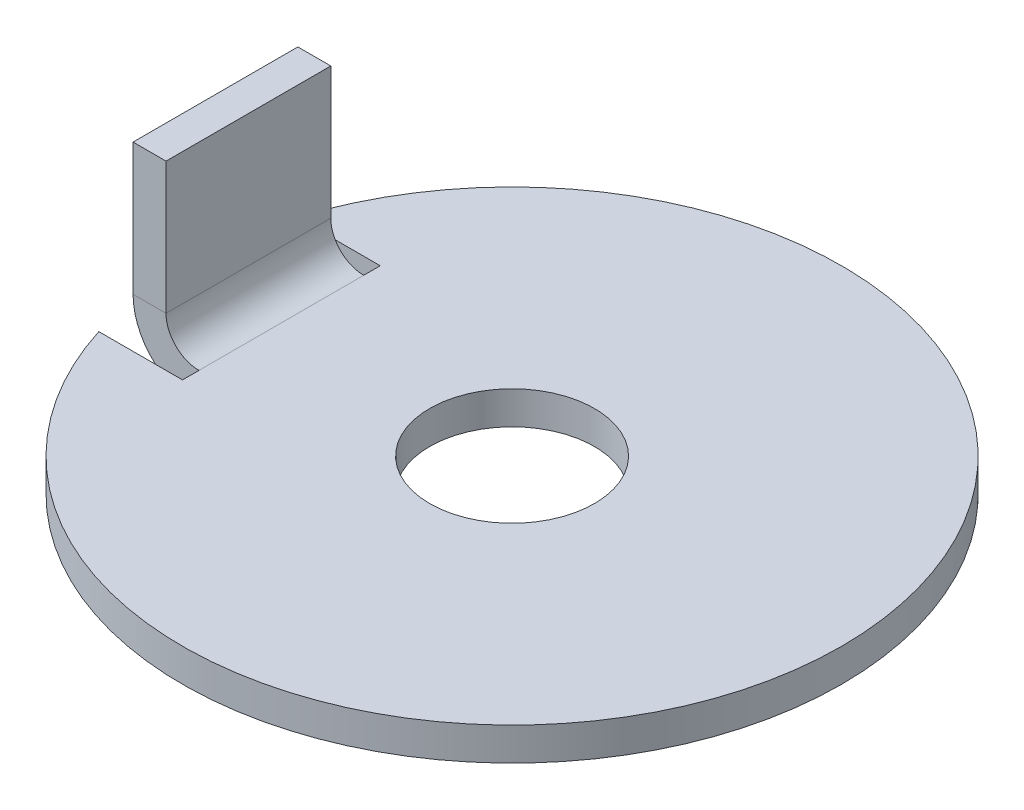
ISO-10303-21;
HEADER;
FILE_DESCRIPTION(('STEP AP214'),'2;1');
FILE_NAME('part.step','',(''),(''),'','','');
FILE_SCHEMA(('AUTOMOTIVE_DESIGN { 1 0 10303 214 1 1 1 1 }'));
ENDSEC;
DATA;
#1=APPLICATION_CONTEXT('core data for automotive mechanical design processes');
#2=APPLICATION_PROTOCOL_DEFINITION('international standard','automotive_design',2000,#1);
#3=PRODUCT_CONTEXT('',#1,'mechanical');
#4=PRODUCT('Part','Part','',(#3));
#5=PRODUCT_RELATED_PRODUCT_CATEGORY('part','',(#4));
#6=PRODUCT_DEFINITION_FORMATION('','',#4);
#7=PRODUCT_DEFINITION_CONTEXT('part definition',#1,'design');
#8=PRODUCT_DEFINITION('design','',#6,#7);
#9=PRODUCT_DEFINITION_SHAPE('','',#8);
#10=(LENGTH_UNIT() NAMED_UNIT(*) SI_UNIT(.MILLI.,.METRE.));
#11=(NAMED_UNIT(*) PLANE_ANGLE_UNIT() SI_UNIT($,.RADIAN.));
#12=(NAMED_UNIT(*) SI_UNIT($,.STERADIAN.) SOLID_ANGLE_UNIT());
#13=UNCERTAINTY_MEASURE_WITH_UNIT(LENGTH_MEASURE(1.E-05),#10,'distance_accuracy_value','');
#14=(GEOMETRIC_REPRESENTATION_CONTEXT(3) GLOBAL_UNCERTAINTY_ASSIGNED_CONTEXT((#13)) GLOBAL_UNIT_ASSIGNED_CONTEXT((#10,
#11,#12)) REPRESENTATION_CONTEXT('',''));
#15=CARTESIAN_POINT('',(0.,0.,0.));
#16=DIRECTION('',(0.,0.,1.));
#17=DIRECTION('',(1.,0.,0.));
#18=AXIS2_PLACEMENT_3D('',#15,#16,#17);
#19=CARTESIAN_POINT('',(-7.,0.,2.5));
#20=DIRECTION('',(0.,0.,1.));
#21=DIRECTION('',(1.,0.,0.));
#22=AXIS2_PLACEMENT_3D('',#19,#20,#21);
#23=PLANE('',#22);
#24=DIRECTION('',(0.,-1.,0.));
#25=VECTOR('',#24,1.);
#26=CARTESIAN_POINT('',(-7.,0.,2.5));
#27=LINE('',#26,#25);
#28=CARTESIAN_POINT('',(-7.,0.,2.5));
#29=VERTEX_POINT('',#28);
#30=CARTESIAN_POINT('',(-7.,-1.,2.5));
#31=VERTEX_POINT('',#30);
#32=EDGE_CURVE('E11',#29,#31,#27,.T.);
#33=ORIENTED_EDGE('',*,*,#32,.F.);
#34=CARTESIAN_POINT('',(-7.,1.,2.5));
#35=DIRECTION('',(0.,0.,-1.));
#36=DIRECTION('',(-1.,0.,0.));
#37=AXIS2_PLACEMENT_3D('',#34,#35,#36);
#38=CIRCLE('',#37,1.);
#39=CARTESIAN_POINT('',(-8.,1.,2.5));
#40=VERTEX_POINT('',#39);
#41=EDGE_CURVE('E125',#40,#29,#38,.F.);
#42=ORIENTED_EDGE('',*,*,#41,.F.);
#43=DIRECTION('',(1.,0.,0.));
#44=VECTOR('',#43,1.);
#45=CARTESIAN_POINT('',(-9.,1.,2.5));
#46=LINE('',#45,#44);
#47=CARTESIAN_POINT('',(-9.,1.,2.5));
#48=VERTEX_POINT('',#47);
#49=EDGE_CURVE('E45',#48,#40,#46,.T.);
#50=ORIENTED_EDGE('',*,*,#49,.F.);
#51=CARTESIAN_POINT('',(-7.,1.,2.5));
#52=DIRECTION('',(0.,0.,1.));
#53=DIRECTION('',(1.,0.,0.));
#54=AXIS2_PLACEMENT_3D('',#51,#52,#53);
#55=CIRCLE('',#54,2.);
#56=EDGE_CURVE('E53',#48,#31,#55,.T.);
#57=ORIENTED_EDGE('',*,*,#56,.T.);
#58=EDGE_LOOP('',(#33,#42,#50,#57));
#59=FACE_BOUND('',#58,.T.);
#60=ADVANCED_FACE('F37',(#59),#23,.T.);
#61=CARTESIAN_POINT('',(-8.,1.,-2.5));
#62=DIRECTION('',(0.,0.,-1.));
#63=DIRECTION('',(-1.,0.,0.));
#64=AXIS2_PLACEMENT_3D('',#61,#62,#63);
#65=PLANE('',#64);
#66=DIRECTION('',(-1.,0.,0.));
#67=VECTOR('',#66,1.);
#68=CARTESIAN_POINT('',(-8.,1.,-2.5));
#69=LINE('',#68,#67);
#70=CARTESIAN_POINT('',(-8.,1.,-2.5));
#71=VERTEX_POINT('',#70);
#72=CARTESIAN_POINT('',(-9.,1.,-2.5));
#73=VERTEX_POINT('',#72);
#74=EDGE_CURVE('E76',#71,#73,#69,.T.);
#75=ORIENTED_EDGE('',*,*,#74,.F.);
#76=CARTESIAN_POINT('',(-7.,1.,-2.5));
#77=DIRECTION('',(0.,0.,-1.));
#78=DIRECTION('',(-1.,0.,0.));
#79=AXIS2_PLACEMENT_3D('',#76,#77,#78);
#80=CIRCLE('',#79,1.);
#81=CARTESIAN_POINT('',(-7.,0.,-2.5));
#82=VERTEX_POINT('',#81);
#83=EDGE_CURVE('E131',#71,#82,#80,.F.);
#84=ORIENTED_EDGE('',*,*,#83,.T.);
#85=DIRECTION('',(0.,1.,0.));
#86=VECTOR('',#85,1.);
#87=CARTESIAN_POINT('',(-7.,-1.,-2.5));
#88=LINE('',#87,#86);
#89=CARTESIAN_POINT('',(-7.,-1.,-2.5));
#90=VERTEX_POINT('',#89);
#91=EDGE_CURVE('E84',#90,#82,#88,.T.);
#92=ORIENTED_EDGE('',*,*,#91,.F.);
#93=CARTESIAN_POINT('',(-7.,1.,-2.5));
#94=DIRECTION('',(0.,0.,1.));
#95=DIRECTION('',(1.,0.,0.));
#96=AXIS2_PLACEMENT_3D('',#93,#94,#95);
#97=CIRCLE('',#96,2.);
#98=EDGE_CURVE('E139',#73,#90,#97,.T.);
#99=ORIENTED_EDGE('',*,*,#98,.F.);
#100=EDGE_LOOP('',(#75,#84,#92,#99));
#101=FACE_BOUND('',#100,.T.);
#102=ADVANCED_FACE('F163',(#101),#65,.T.);
#103=CARTESIAN_POINT('',(-7.,-1.,-2.5));
#104=DIRECTION('',(0.,0.,-1.));
#105=DIRECTION('',(-1.,0.,0.));
#106=AXIS2_PLACEMENT_3D('',#103,#104,#105);
#107=PLANE('',#106);
#108=DIRECTION('',(0.,-1.,0.));
#109=VECTOR('',#108,1.);
#110=CARTESIAN_POINT('',(-8.,5.,-2.5));
#111=LINE('',#110,#109);
#112=CARTESIAN_POINT('',(-8.,5.,-2.5));
#113=VERTEX_POINT('',#112);
#114=EDGE_CURVE('E133',#113,#71,#111,.T.);
#115=ORIENTED_EDGE('',*,*,#114,.T.);
#116=ORIENTED_EDGE('',*,*,#74,.T.);
#117=DIRECTION('',(0.,1.,0.));
#118=VECTOR('',#117,1.);
#119=CARTESIAN_POINT('',(-9.,5.,-2.5));
#120=LINE('',#119,#118);
#121=CARTESIAN_POINT('',(-9.,5.,-2.5));
#122=VERTEX_POINT('',#121);
#123=EDGE_CURVE('E137',#122,#73,#120,.F.);
#124=ORIENTED_EDGE('',*,*,#123,.F.);
#125=DIRECTION('',(1.,0.,0.));
#126=VECTOR('',#125,1.);
#127=CARTESIAN_POINT('',(-9.,5.,-2.5));
#128=LINE('',#127,#126);
#129=EDGE_CURVE('E108',#122,#113,#128,.T.);
#130=ORIENTED_EDGE('',*,*,#129,.T.);
#131=EDGE_LOOP('',(#115,#116,#124,#130));
#132=FACE_BOUND('',#131,.T.);
#133=ADVANCED_FACE('F160',(#132),#107,.T.);
#134=CARTESIAN_POINT('',(-8.,-1.,2.5));
#135=DIRECTION('',(0.,1.,0.));
#136=DIRECTION('',(0.,0.,1.));
#137=AXIS2_PLACEMENT_3D('',#134,#135,#136);
#138=PLANE('',#137);
#139=CARTESIAN_POINT('',(0.,-1.,0.));
#140=DIRECTION('',(0.,1.,0.));
#141=DIRECTION('',(0.,0.,1.));
#142=AXIS2_PLACEMENT_3D('',#139,#140,#141);
#143=CIRCLE('',#142,2.5);
#144=CARTESIAN_POINT('',(0.,-1.,2.5));
#145=VERTEX_POINT('',#144);
#146=EDGE_CURVE('E215',#145,#145,#143,.T.);
#147=ORIENTED_EDGE('',*,*,#146,.T.);
#148=EDGE_LOOP('',(#147));
#149=FACE_BOUND('',#148,.T.);
#150=DIRECTION('',(0.,0.,-1.));
#151=VECTOR('',#150,1.);
#152=CARTESIAN_POINT('',(-7.,-1.,2.5));
#153=LINE('',#152,#151);
#154=EDGE_CURVE('E130',#31,#90,#153,.T.);
#155=ORIENTED_EDGE('',*,*,#154,.T.);
#156=DIRECTION('',(0.,0.,1.));
#157=VECTOR('',#156,1.);
#158=CARTESIAN_POINT('',(-7.,-1.,3.));
#159=LINE('',#158,#157);
#160=CARTESIAN_POINT('',(-7.,-1.,-3.));
#161=VERTEX_POINT('',#160);
#162=EDGE_CURVE('E173',#161,#90,#159,.T.);
#163=ORIENTED_EDGE('',*,*,#162,.F.);
#164=DIRECTION('',(1.,0.,0.));
#165=VECTOR('',#164,1.);
#166=CARTESIAN_POINT('',(-7.,-1.,-3.));
#167=LINE('',#166,#165);
#168=CARTESIAN_POINT('',(-9.53939201416946,-1.,-3.));
#169=VERTEX_POINT('',#168);
#170=EDGE_CURVE('E208',#169,#161,#167,.T.);
#171=ORIENTED_EDGE('',*,*,#170,.F.);
#172=CARTESIAN_POINT('',(0.,-1.,0.));
#173=DIRECTION('',(0.,1.,0.));
#174=DIRECTION('',(0.,0.,1.));
#175=AXIS2_PLACEMENT_3D('',#172,#173,#174);
#176=CIRCLE('',#175,10.);
#177=CARTESIAN_POINT('',(-9.53939201416946,-1.,3.));
#178=VERTEX_POINT('',#177);
#179=EDGE_CURVE('E185',#178,#169,#176,.T.);
#180=ORIENTED_EDGE('',*,*,#179,.F.);
#181=DIRECTION('',(-1.,0.,0.));
#182=VECTOR('',#181,1.);
#183=CARTESIAN_POINT('',(-7.,-1.,3.));
#184=LINE('',#183,#182);
#185=CARTESIAN_POINT('',(-7.,-1.,3.));
#186=VERTEX_POINT('',#185);
#187=EDGE_CURVE('E181',#186,#178,#184,.T.);
#188=ORIENTED_EDGE('',*,*,#187,.F.);
#189=EDGE_CURVE('E205',#31,#186,#159,.T.);
#190=ORIENTED_EDGE('',*,*,#189,.F.);
#191=EDGE_LOOP('',(#155,#163,#171,#180,#188,#190));
#192=FACE_BOUND('',#191,.T.);
#193=ADVANCED_FACE('F240',(#149,#192),#138,.F.);
#194=CARTESIAN_POINT('',(-8.,0.,2.5));
#195=DIRECTION('',(0.,1.,0.));
#196=DIRECTION('',(0.,0.,1.));
#197=AXIS2_PLACEMENT_3D('',#194,#195,#196);
#198=PLANE('',#197);
#199=CARTESIAN_POINT('',(0.,0.,0.));
#200=DIRECTION('',(0.,1.,0.));
#201=DIRECTION('',(0.,0.,1.));
#202=AXIS2_PLACEMENT_3D('',#199,#200,#201);
#203=CIRCLE('',#202,2.5);
#204=CARTESIAN_POINT('',(0.,0.,2.5));
#205=VERTEX_POINT('',#204);
#206=EDGE_CURVE('E243',#205,#205,#203,.T.);
#207=ORIENTED_EDGE('',*,*,#206,.F.);
#208=EDGE_LOOP('',(#207));
#209=FACE_BOUND('',#208,.T.);
#210=DIRECTION('',(0.,0.,-1.));
#211=VECTOR('',#210,1.);
#212=CARTESIAN_POINT('',(-7.,0.,2.5));
#213=LINE('',#212,#211);
#214=EDGE_CURVE('E148',#29,#82,#213,.T.);
#215=ORIENTED_EDGE('',*,*,#214,.F.);
#216=DIRECTION('',(0.,0.,1.));
#217=VECTOR('',#216,1.);
#218=CARTESIAN_POINT('',(-7.,0.,3.));
#219=LINE('',#218,#217);
#220=CARTESIAN_POINT('',(-7.,0.,3.));
#221=VERTEX_POINT('',#220);
#222=EDGE_CURVE('E182',#29,#221,#219,.T.);
#223=ORIENTED_EDGE('',*,*,#222,.T.);
#224=DIRECTION('',(-1.,0.,0.));
#225=VECTOR('',#224,1.);
#226=CARTESIAN_POINT('',(-7.,0.,3.));
#227=LINE('',#226,#225);
#228=CARTESIAN_POINT('',(-9.53939201416946,0.,3.));
#229=VERTEX_POINT('',#228);
#230=EDGE_CURVE('E212',#221,#229,#227,.T.);
#231=ORIENTED_EDGE('',*,*,#230,.T.);
#232=CARTESIAN_POINT('',(0.,0.,0.));
#233=DIRECTION('',(0.,1.,0.));
#234=DIRECTION('',(0.,0.,1.));
#235=AXIS2_PLACEMENT_3D('',#232,#233,#234);
#236=CIRCLE('',#235,10.);
#237=CARTESIAN_POINT('',(-9.53939201416946,0.,-3.));
#238=VERTEX_POINT('',#237);
#239=EDGE_CURVE('E214',#229,#238,#236,.T.);
#240=ORIENTED_EDGE('',*,*,#239,.T.);
#241=DIRECTION('',(1.,0.,0.));
#242=VECTOR('',#241,1.);
#243=CARTESIAN_POINT('',(-7.,0.,-3.));
#244=LINE('',#243,#242);
#245=CARTESIAN_POINT('',(-7.,0.,-3.));
#246=VERTEX_POINT('',#245);
#247=EDGE_CURVE('E180',#238,#246,#244,.T.);
#248=ORIENTED_EDGE('',*,*,#247,.T.);
#249=EDGE_CURVE('E171',#246,#82,#219,.T.);
#250=ORIENTED_EDGE('',*,*,#249,.T.);
#251=EDGE_LOOP('',(#215,#223,#231,#240,#248,#250));
#252=FACE_BOUND('',#251,.T.);
#253=ADVANCED_FACE('F176',(#209,#252),#198,.T.);
#254=CARTESIAN_POINT('',(-7.,1.,2.5));
#255=DIRECTION('',(0.,0.,-1.));
#256=DIRECTION('',(-1.,0.,0.));
#257=AXIS2_PLACEMENT_3D('',#254,#255,#256);
#258=CYLINDRICAL_SURFACE('',#257,1.);
#259=ORIENTED_EDGE('',*,*,#83,.F.);
#260=DIRECTION('',(0.,0.,-1.));
#261=VECTOR('',#260,1.);
#262=CARTESIAN_POINT('',(-8.,1.,2.5));
#263=LINE('',#262,#261);
#264=EDGE_CURVE('E145',#40,#71,#263,.T.);
#265=ORIENTED_EDGE('',*,*,#264,.F.);
#266=ORIENTED_EDGE('',*,*,#41,.T.);
#267=ORIENTED_EDGE('',*,*,#214,.T.);
#268=EDGE_LOOP('',(#259,#265,#266,#267));
#269=FACE_BOUND('',#268,.T.);
#270=ADVANCED_FACE('F155',(#269),#258,.F.);
#271=CARTESIAN_POINT('',(-8.,5.,2.5));
#272=DIRECTION('',(1.,0.,0.));
#273=DIRECTION('',(0.,0.,-1.));
#274=AXIS2_PLACEMENT_3D('',#271,#272,#273);
#275=PLANE('',#274);
#276=ORIENTED_EDGE('',*,*,#114,.F.);
#277=DIRECTION('',(0.,0.,-1.));
#278=VECTOR('',#277,1.);
#279=CARTESIAN_POINT('',(-8.,5.,2.5));
#280=LINE('',#279,#278);
#281=CARTESIAN_POINT('',(-8.,5.,2.5));
#282=VERTEX_POINT('',#281);
#283=EDGE_CURVE('E110',#282,#113,#280,.T.);
#284=ORIENTED_EDGE('',*,*,#283,.F.);
#285=DIRECTION('',(0.,-1.,0.));
#286=VECTOR('',#285,1.);
#287=CARTESIAN_POINT('',(-8.,5.,2.5));
#288=LINE('',#287,#286);
#289=EDGE_CURVE('E123',#282,#40,#288,.T.);
#290=ORIENTED_EDGE('',*,*,#289,.T.);
#291=ORIENTED_EDGE('',*,*,#264,.T.);
#292=EDGE_LOOP('',(#276,#284,#290,#291));
#293=FACE_BOUND('',#292,.T.);
#294=ADVANCED_FACE('F159',(#293),#275,.T.);
#295=CARTESIAN_POINT('',(-9.,5.,2.5));
#296=DIRECTION('',(0.,1.,0.));
#297=DIRECTION('',(0.,0.,1.));
#298=AXIS2_PLACEMENT_3D('',#295,#296,#297);
#299=PLANE('',#298);
#300=ORIENTED_EDGE('',*,*,#129,.F.);
#301=DIRECTION('',(0.,0.,-1.));
#302=VECTOR('',#301,1.);
#303=CARTESIAN_POINT('',(-9.,5.,2.5));
#304=LINE('',#303,#302);
#305=CARTESIAN_POINT('',(-9.,5.,2.5));
#306=VERTEX_POINT('',#305);
#307=EDGE_CURVE('E102',#306,#122,#304,.T.);
#308=ORIENTED_EDGE('',*,*,#307,.F.);
#309=DIRECTION('',(1.,0.,0.));
#310=VECTOR('',#309,1.);
#311=CARTESIAN_POINT('',(-9.,5.,2.5));
#312=LINE('',#311,#310);
#313=EDGE_CURVE('E106',#306,#282,#312,.T.);
#314=ORIENTED_EDGE('',*,*,#313,.T.);
#315=ORIENTED_EDGE('',*,*,#283,.T.);
#316=EDGE_LOOP('',(#300,#308,#314,#315));
#317=FACE_BOUND('',#316,.T.);
#318=ADVANCED_FACE('F104',(#317),#299,.T.);
#319=CARTESIAN_POINT('',(-9.,5.,2.5));
#320=DIRECTION('',(1.,0.,0.));
#321=DIRECTION('',(0.,0.,-1.));
#322=AXIS2_PLACEMENT_3D('',#319,#320,#321);
#323=PLANE('',#322);
#324=ORIENTED_EDGE('',*,*,#123,.T.);
#325=DIRECTION('',(0.,0.,-1.));
#326=VECTOR('',#325,1.);
#327=CARTESIAN_POINT('',(-9.,1.,2.5));
#328=LINE('',#327,#326);
#329=EDGE_CURVE('E111',#48,#73,#328,.T.);
#330=ORIENTED_EDGE('',*,*,#329,.F.);
#331=DIRECTION('',(0.,1.,0.));
#332=VECTOR('',#331,1.);
#333=CARTESIAN_POINT('',(-9.,5.,2.5));
#334=LINE('',#333,#332);
#335=EDGE_CURVE('E115',#306,#48,#334,.F.);
#336=ORIENTED_EDGE('',*,*,#335,.F.);
#337=ORIENTED_EDGE('',*,*,#307,.T.);
#338=EDGE_LOOP('',(#324,#330,#336,#337));
#339=FACE_BOUND('',#338,.T.);
#340=ADVANCED_FACE('F116',(#339),#323,.F.);
#341=CARTESIAN_POINT('',(-7.,1.,2.5));
#342=DIRECTION('',(0.,0.,-1.));
#343=DIRECTION('',(-1.,0.,0.));
#344=AXIS2_PLACEMENT_3D('',#341,#342,#343);
#345=CYLINDRICAL_SURFACE('',#344,2.);
#346=ORIENTED_EDGE('',*,*,#98,.T.);
#347=ORIENTED_EDGE('',*,*,#154,.F.);
#348=ORIENTED_EDGE('',*,*,#56,.F.);
#349=ORIENTED_EDGE('',*,*,#329,.T.);
#350=EDGE_LOOP('',(#346,#347,#348,#349));
#351=FACE_BOUND('',#350,.T.);
#352=ADVANCED_FACE('F162',(#351),#345,.T.);
#353=CARTESIAN_POINT('',(-7.,1.,2.5));
#354=DIRECTION('',(0.,0.,-1.));
#355=DIRECTION('',(-1.,0.,0.));
#356=AXIS2_PLACEMENT_3D('',#353,#354,#355);
#357=PLANE('',#356);
#358=ORIENTED_EDGE('',*,*,#335,.T.);
#359=ORIENTED_EDGE('',*,*,#49,.T.);
#360=ORIENTED_EDGE('',*,*,#289,.F.);
#361=ORIENTED_EDGE('',*,*,#313,.F.);
#362=EDGE_LOOP('',(#358,#359,#360,#361));
#363=FACE_BOUND('',#362,.T.);
#364=ADVANCED_FACE('F121',(#363),#357,.F.);
#365=CARTESIAN_POINT('',(-7.,-1.,3.));
#366=DIRECTION('',(-1.,0.,0.));
#367=DIRECTION('',(0.,0.,1.));
#368=AXIS2_PLACEMENT_3D('',#365,#366,#367);
#369=PLANE('',#368);
#370=ORIENTED_EDGE('',*,*,#222,.F.);
#371=ORIENTED_EDGE('',*,*,#32,.T.);
#372=ORIENTED_EDGE('',*,*,#189,.T.);
#373=DIRECTION('',(0.,1.,0.));
#374=VECTOR('',#373,1.);
#375=CARTESIAN_POINT('',(-7.,-1.,3.));
#376=LINE('',#375,#374);
#377=EDGE_CURVE('E134',#186,#221,#376,.T.);
#378=ORIENTED_EDGE('',*,*,#377,.T.);
#379=EDGE_LOOP('',(#370,#371,#372,#378));
#380=FACE_BOUND('',#379,.T.);
#381=ADVANCED_FACE('F236',(#380),#369,.T.);
#382=CARTESIAN_POINT('',(-7.,-1.,3.));
#383=DIRECTION('',(0.,0.,-1.));
#384=DIRECTION('',(-1.,0.,0.));
#385=AXIS2_PLACEMENT_3D('',#382,#383,#384);
#386=PLANE('',#385);
#387=ORIENTED_EDGE('',*,*,#230,.F.);
#388=ORIENTED_EDGE('',*,*,#377,.F.);
#389=ORIENTED_EDGE('',*,*,#187,.T.);
#390=DIRECTION('',(0.,1.,0.));
#391=VECTOR('',#390,1.);
#392=CARTESIAN_POINT('',(-9.53939201416946,-1.,3.));
#393=LINE('',#392,#391);
#394=EDGE_CURVE('E198',#178,#229,#393,.T.);
#395=ORIENTED_EDGE('',*,*,#394,.T.);
#396=EDGE_LOOP('',(#387,#388,#389,#395));
#397=FACE_BOUND('',#396,.T.);
#398=ADVANCED_FACE('F239',(#397),#386,.T.);
#399=ORIENTED_EDGE('',*,*,#162,.T.);
#400=ORIENTED_EDGE('',*,*,#91,.T.);
#401=ORIENTED_EDGE('',*,*,#249,.F.);
#402=DIRECTION('',(0.,1.,0.));
#403=VECTOR('',#402,1.);
#404=CARTESIAN_POINT('',(-7.,-1.,-3.));
#405=LINE('',#404,#403);
#406=EDGE_CURVE('E192',#161,#246,#405,.T.);
#407=ORIENTED_EDGE('',*,*,#406,.F.);
#408=EDGE_LOOP('',(#399,#400,#401,#407));
#409=FACE_BOUND('',#408,.T.);
#410=ADVANCED_FACE('F168',(#409),#369,.T.);
#411=CARTESIAN_POINT('',(-7.,-1.,-3.));
#412=DIRECTION('',(0.,0.,1.));
#413=DIRECTION('',(1.,0.,0.));
#414=AXIS2_PLACEMENT_3D('',#411,#412,#413);
#415=PLANE('',#414);
#416=ORIENTED_EDGE('',*,*,#247,.F.);
#417=DIRECTION('',(0.,1.,0.));
#418=VECTOR('',#417,1.);
#419=CARTESIAN_POINT('',(-9.53939201416946,-1.,-3.));
#420=LINE('',#419,#418);
#421=EDGE_CURVE('E195',#169,#238,#420,.T.);
#422=ORIENTED_EDGE('',*,*,#421,.F.);
#423=ORIENTED_EDGE('',*,*,#170,.T.);
#424=ORIENTED_EDGE('',*,*,#406,.T.);
#425=EDGE_LOOP('',(#416,#422,#423,#424));
#426=FACE_BOUND('',#425,.T.);
#427=ADVANCED_FACE('F257',(#426),#415,.T.);
#428=CARTESIAN_POINT('',(0.,-1.,0.));
#429=DIRECTION('',(0.,1.,0.));
#430=DIRECTION('',(0.,0.,1.));
#431=AXIS2_PLACEMENT_3D('',#428,#429,#430);
#432=CYLINDRICAL_SURFACE('',#431,10.);
#433=ORIENTED_EDGE('',*,*,#239,.F.);
#434=ORIENTED_EDGE('',*,*,#394,.F.);
#435=ORIENTED_EDGE('',*,*,#179,.T.);
#436=ORIENTED_EDGE('',*,*,#421,.T.);
#437=EDGE_LOOP('',(#433,#434,#435,#436));
#438=FACE_BOUND('',#437,.T.);
#439=ADVANCED_FACE('F219',(#438),#432,.T.);
#440=CARTESIAN_POINT('',(0.,-1.,0.));
#441=DIRECTION('',(0.,1.,0.));
#442=DIRECTION('',(0.,0.,1.));
#443=AXIS2_PLACEMENT_3D('',#440,#441,#442);
#444=CYLINDRICAL_SURFACE('',#443,2.5);
#445=ORIENTED_EDGE('',*,*,#206,.T.);
#446=EDGE_LOOP('',(#445));
#447=FACE_BOUND('',#446,.T.);
#448=ORIENTED_EDGE('',*,*,#146,.F.);
#449=EDGE_LOOP('',(#448));
#450=FACE_BOUND('',#449,.T.);
#451=ADVANCED_FACE('F250',(#447,#450),#444,.F.);
#452=CLOSED_SHELL('',(#60,#102,#133,#193,#253,#270,#294,#318,#340,#352,#364,#381,#398,#410,#427,
#439,#451));
#453=MANIFOLD_SOLID_BREP('B2',#452);
#454=ADVANCED_BREP_SHAPE_REPRESENTATION('',(#18,#453),#14);
#455=SHAPE_DEFINITION_REPRESENTATION(#9,#454);
ENDSEC;
END-ISO-10303-21;
